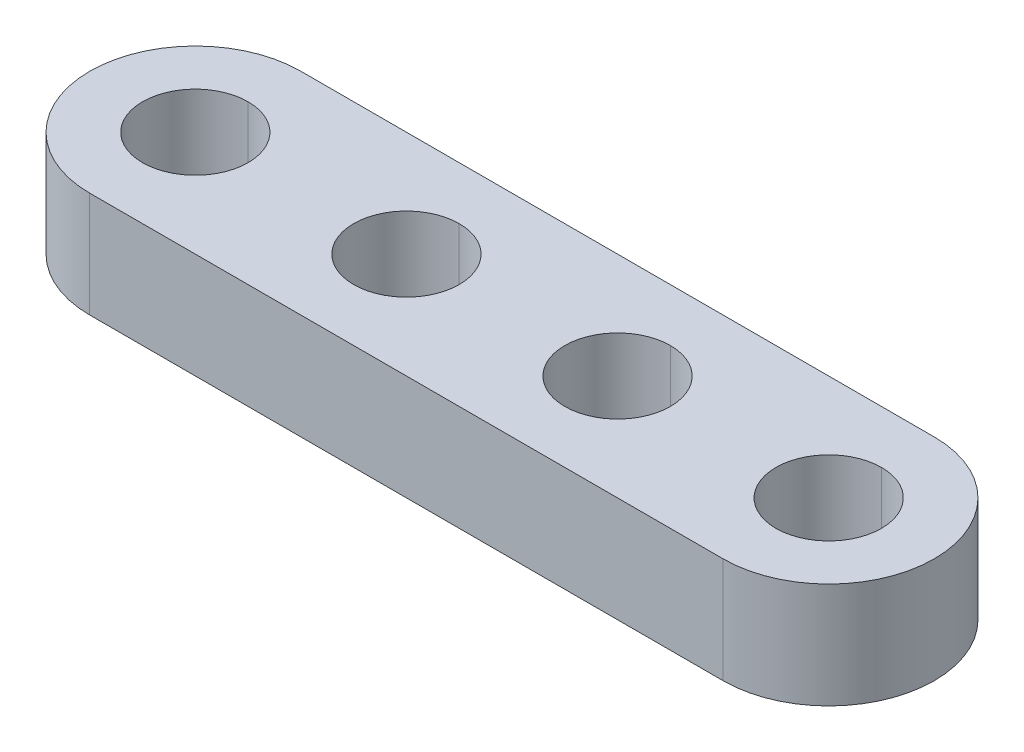
ISO-10303-21;
HEADER;
FILE_DESCRIPTION(('STEP AP214'),'2;1');
FILE_NAME('part.step','',(''),(''),'','','');
FILE_SCHEMA(('AUTOMOTIVE_DESIGN { 1 0 10303 214 1 1 1 1 }'));
ENDSEC;
DATA;
#1=APPLICATION_CONTEXT('core data for automotive mechanical design processes');
#2=APPLICATION_PROTOCOL_DEFINITION('international standard','automotive_design',2000,#1);
#3=PRODUCT_CONTEXT('',#1,'mechanical');
#4=PRODUCT('Part','Part','',(#3));
#5=PRODUCT_RELATED_PRODUCT_CATEGORY('part','',(#4));
#6=PRODUCT_DEFINITION_FORMATION('','',#4);
#7=PRODUCT_DEFINITION_CONTEXT('part definition',#1,'design');
#8=PRODUCT_DEFINITION('design','',#6,#7);
#9=PRODUCT_DEFINITION_SHAPE('','',#8);
#10=(LENGTH_UNIT() NAMED_UNIT(*) SI_UNIT(.MILLI.,.METRE.));
#11=(NAMED_UNIT(*) PLANE_ANGLE_UNIT() SI_UNIT($,.RADIAN.));
#12=(NAMED_UNIT(*) SI_UNIT($,.STERADIAN.) SOLID_ANGLE_UNIT());
#13=UNCERTAINTY_MEASURE_WITH_UNIT(LENGTH_MEASURE(1.E-05),#10,'distance_accuracy_value','');
#14=(GEOMETRIC_REPRESENTATION_CONTEXT(3) GLOBAL_UNCERTAINTY_ASSIGNED_CONTEXT((#13)) GLOBAL_UNIT_ASSIGNED_CONTEXT((#10,
#11,#12)) REPRESENTATION_CONTEXT('',''));
#15=CARTESIAN_POINT('',(0.,0.,0.));
#16=DIRECTION('',(0.,0.,1.));
#17=DIRECTION('',(1.,0.,0.));
#18=AXIS2_PLACEMENT_3D('',#15,#16,#17);
#19=CARTESIAN_POINT('',(12.,4.,0.));
#20=DIRECTION('',(0.,1.,0.));
#21=DIRECTION('',(0.,0.,1.));
#22=AXIS2_PLACEMENT_3D('',#19,#20,#21);
#23=CYLINDRICAL_SURFACE('',#22,2.);
#24=DIRECTION('',(0.,1.,0.));
#25=VECTOR('',#24,1.);
#26=CARTESIAN_POINT('',(12.,4.,-2.));
#27=LINE('',#26,#25);
#28=CARTESIAN_POINT('',(12.,0.,-2.));
#29=VERTEX_POINT('',#28);
#30=CARTESIAN_POINT('',(12.,4.,-2.));
#31=VERTEX_POINT('',#30);
#32=EDGE_CURVE('E249',#29,#31,#27,.T.);
#33=ORIENTED_EDGE('',*,*,#32,.F.);
#34=CARTESIAN_POINT('',(12.,0.,0.));
#35=DIRECTION('',(0.,1.,0.));
#36=DIRECTION('',(0.,0.,1.));
#37=AXIS2_PLACEMENT_3D('',#34,#35,#36);
#38=CIRCLE('',#37,2.);
#39=CARTESIAN_POINT('',(12.,0.,2.));
#40=VERTEX_POINT('',#39);
#41=EDGE_CURVE('E176',#40,#29,#38,.T.);
#42=ORIENTED_EDGE('',*,*,#41,.F.);
#43=DIRECTION('',(0.,1.,0.));
#44=VECTOR('',#43,1.);
#45=CARTESIAN_POINT('',(12.,4.,2.));
#46=LINE('',#45,#44);
#47=CARTESIAN_POINT('',(12.,4.,2.));
#48=VERTEX_POINT('',#47);
#49=EDGE_CURVE('E217',#40,#48,#46,.T.);
#50=ORIENTED_EDGE('',*,*,#49,.T.);
#51=CARTESIAN_POINT('',(12.,4.,0.));
#52=DIRECTION('',(0.,1.,0.));
#53=DIRECTION('',(0.,0.,1.));
#54=AXIS2_PLACEMENT_3D('',#51,#52,#53);
#55=CIRCLE('',#54,2.);
#56=EDGE_CURVE('E196',#48,#31,#55,.T.);
#57=ORIENTED_EDGE('',*,*,#56,.T.);
#58=EDGE_LOOP('',(#33,#42,#50,#57));
#59=FACE_BOUND('',#58,.T.);
#60=ADVANCED_FACE('F14',(#59),#23,.F.);
#61=CARTESIAN_POINT('',(4.,4.,0.));
#62=DIRECTION('',(0.,1.,0.));
#63=DIRECTION('',(0.,0.,1.));
#64=AXIS2_PLACEMENT_3D('',#61,#62,#63);
#65=CYLINDRICAL_SURFACE('',#64,2.);
#66=DIRECTION('',(0.,1.,0.));
#67=VECTOR('',#66,1.);
#68=CARTESIAN_POINT('',(4.,4.,-2.));
#69=LINE('',#68,#67);
#70=CARTESIAN_POINT('',(4.,0.,-2.));
#71=VERTEX_POINT('',#70);
#72=CARTESIAN_POINT('',(4.,4.,-2.));
#73=VERTEX_POINT('',#72);
#74=EDGE_CURVE('E216',#71,#73,#69,.T.);
#75=ORIENTED_EDGE('',*,*,#74,.F.);
#76=CARTESIAN_POINT('',(4.,0.,0.));
#77=DIRECTION('',(0.,1.,0.));
#78=DIRECTION('',(0.,0.,1.));
#79=AXIS2_PLACEMENT_3D('',#76,#77,#78);
#80=CIRCLE('',#79,2.);
#81=CARTESIAN_POINT('',(4.,0.,2.));
#82=VERTEX_POINT('',#81);
#83=EDGE_CURVE('E183',#82,#71,#80,.T.);
#84=ORIENTED_EDGE('',*,*,#83,.F.);
#85=DIRECTION('',(0.,1.,0.));
#86=VECTOR('',#85,1.);
#87=CARTESIAN_POINT('',(4.,4.,2.));
#88=LINE('',#87,#86);
#89=CARTESIAN_POINT('',(4.,4.,2.));
#90=VERTEX_POINT('',#89);
#91=EDGE_CURVE('E226',#82,#90,#88,.T.);
#92=ORIENTED_EDGE('',*,*,#91,.T.);
#93=CARTESIAN_POINT('',(4.,4.,0.));
#94=DIRECTION('',(0.,1.,0.));
#95=DIRECTION('',(0.,0.,1.));
#96=AXIS2_PLACEMENT_3D('',#93,#94,#95);
#97=CIRCLE('',#96,2.);
#98=EDGE_CURVE('E186',#90,#73,#97,.T.);
#99=ORIENTED_EDGE('',*,*,#98,.T.);
#100=EDGE_LOOP('',(#75,#84,#92,#99));
#101=FACE_BOUND('',#100,.T.);
#102=ADVANCED_FACE('F16',(#101),#65,.F.);
#103=CARTESIAN_POINT('',(-4.,4.,0.));
#104=DIRECTION('',(0.,1.,0.));
#105=DIRECTION('',(0.,0.,1.));
#106=AXIS2_PLACEMENT_3D('',#103,#104,#105);
#107=CYLINDRICAL_SURFACE('',#106,2.);
#108=DIRECTION('',(0.,1.,0.));
#109=VECTOR('',#108,1.);
#110=CARTESIAN_POINT('',(-4.,4.,-2.));
#111=LINE('',#110,#109);
#112=CARTESIAN_POINT('',(-4.,0.,-2.));
#113=VERTEX_POINT('',#112);
#114=CARTESIAN_POINT('',(-4.,4.,-2.));
#115=VERTEX_POINT('',#114);
#116=EDGE_CURVE('E206',#113,#115,#111,.T.);
#117=ORIENTED_EDGE('',*,*,#116,.F.);
#118=CARTESIAN_POINT('',(-4.,0.,0.));
#119=DIRECTION('',(0.,1.,0.));
#120=DIRECTION('',(0.,0.,1.));
#121=AXIS2_PLACEMENT_3D('',#118,#119,#120);
#122=CIRCLE('',#121,2.);
#123=CARTESIAN_POINT('',(-4.,0.,2.));
#124=VERTEX_POINT('',#123);
#125=EDGE_CURVE('E25',#124,#113,#122,.T.);
#126=ORIENTED_EDGE('',*,*,#125,.F.);
#127=DIRECTION('',(0.,1.,0.));
#128=VECTOR('',#127,1.);
#129=CARTESIAN_POINT('',(-4.,4.,2.));
#130=LINE('',#129,#128);
#131=CARTESIAN_POINT('',(-4.,4.,2.));
#132=VERTEX_POINT('',#131);
#133=EDGE_CURVE('E199',#124,#132,#130,.T.);
#134=ORIENTED_EDGE('',*,*,#133,.T.);
#135=CARTESIAN_POINT('',(-4.,4.,0.));
#136=DIRECTION('',(0.,1.,0.));
#137=DIRECTION('',(0.,0.,1.));
#138=AXIS2_PLACEMENT_3D('',#135,#136,#137);
#139=CIRCLE('',#138,2.);
#140=EDGE_CURVE('E177',#132,#115,#139,.T.);
#141=ORIENTED_EDGE('',*,*,#140,.T.);
#142=EDGE_LOOP('',(#117,#126,#134,#141));
#143=FACE_BOUND('',#142,.T.);
#144=ADVANCED_FACE('F279',(#143),#107,.F.);
#145=CARTESIAN_POINT('',(-12.,4.,0.));
#146=DIRECTION('',(0.,1.,0.));
#147=DIRECTION('',(0.,0.,1.));
#148=AXIS2_PLACEMENT_3D('',#145,#146,#147);
#149=CYLINDRICAL_SURFACE('',#148,2.);
#150=DIRECTION('',(0.,1.,0.));
#151=VECTOR('',#150,1.);
#152=CARTESIAN_POINT('',(-12.,4.,-2.));
#153=LINE('',#152,#151);
#154=CARTESIAN_POINT('',(-12.,0.,-2.));
#155=VERTEX_POINT('',#154);
#156=CARTESIAN_POINT('',(-12.,4.,-2.));
#157=VERTEX_POINT('',#156);
#158=EDGE_CURVE('E18',#155,#157,#153,.T.);
#159=ORIENTED_EDGE('',*,*,#158,.F.);
#160=CARTESIAN_POINT('',(-12.,0.,0.));
#161=DIRECTION('',(0.,1.,0.));
#162=DIRECTION('',(0.,0.,1.));
#163=AXIS2_PLACEMENT_3D('',#160,#161,#162);
#164=CIRCLE('',#163,2.);
#165=CARTESIAN_POINT('',(-12.,0.,2.));
#166=VERTEX_POINT('',#165);
#167=EDGE_CURVE('E9',#166,#155,#164,.T.);
#168=ORIENTED_EDGE('',*,*,#167,.F.);
#169=DIRECTION('',(0.,1.,0.));
#170=VECTOR('',#169,1.);
#171=CARTESIAN_POINT('',(-12.,4.,2.));
#172=LINE('',#171,#170);
#173=CARTESIAN_POINT('',(-12.,4.,2.));
#174=VERTEX_POINT('',#173);
#175=EDGE_CURVE('E218',#166,#174,#172,.T.);
#176=ORIENTED_EDGE('',*,*,#175,.T.);
#177=CARTESIAN_POINT('',(-12.,4.,0.));
#178=DIRECTION('',(0.,1.,0.));
#179=DIRECTION('',(0.,0.,1.));
#180=AXIS2_PLACEMENT_3D('',#177,#178,#179);
#181=CIRCLE('',#180,2.);
#182=EDGE_CURVE('E125',#174,#157,#181,.T.);
#183=ORIENTED_EDGE('',*,*,#182,.T.);
#184=EDGE_LOOP('',(#159,#168,#176,#183));
#185=FACE_BOUND('',#184,.T.);
#186=ADVANCED_FACE('F299',(#185),#149,.F.);
#187=CARTESIAN_POINT('',(-12.,0.,0.));
#188=DIRECTION('',(0.,1.,0.));
#189=DIRECTION('',(1.,0.,0.));
#190=AXIS2_PLACEMENT_3D('',#187,#188,#189);
#191=PLANE('',#190);
#192=ORIENTED_EDGE('',*,*,#167,.T.);
#193=CARTESIAN_POINT('',(-12.,0.,0.));
#194=DIRECTION('',(0.,1.,0.));
#195=DIRECTION('',(0.,0.,1.));
#196=AXIS2_PLACEMENT_3D('',#193,#194,#195);
#197=CIRCLE('',#196,2.);
#198=EDGE_CURVE('E282',#155,#166,#197,.T.);
#199=ORIENTED_EDGE('',*,*,#198,.T.);
#200=EDGE_LOOP('',(#192,#199));
#201=FACE_BOUND('',#200,.T.);
#202=ORIENTED_EDGE('',*,*,#125,.T.);
#203=CARTESIAN_POINT('',(-4.,0.,0.));
#204=DIRECTION('',(0.,1.,0.));
#205=DIRECTION('',(0.,0.,1.));
#206=AXIS2_PLACEMENT_3D('',#203,#204,#205);
#207=CIRCLE('',#206,2.);
#208=EDGE_CURVE('E211',#113,#124,#207,.T.);
#209=ORIENTED_EDGE('',*,*,#208,.T.);
#210=EDGE_LOOP('',(#202,#209));
#211=FACE_BOUND('',#210,.T.);
#212=ORIENTED_EDGE('',*,*,#83,.T.);
#213=CARTESIAN_POINT('',(4.,0.,0.));
#214=DIRECTION('',(0.,1.,0.));
#215=DIRECTION('',(0.,0.,1.));
#216=AXIS2_PLACEMENT_3D('',#213,#214,#215);
#217=CIRCLE('',#216,2.);
#218=EDGE_CURVE('E212',#71,#82,#217,.T.);
#219=ORIENTED_EDGE('',*,*,#218,.T.);
#220=EDGE_LOOP('',(#212,#219));
#221=FACE_BOUND('',#220,.T.);
#222=ORIENTED_EDGE('',*,*,#41,.T.);
#223=CARTESIAN_POINT('',(12.,0.,0.));
#224=DIRECTION('',(0.,1.,0.));
#225=DIRECTION('',(0.,0.,1.));
#226=AXIS2_PLACEMENT_3D('',#223,#224,#225);
#227=CIRCLE('',#226,2.);
#228=EDGE_CURVE('E253',#29,#40,#227,.T.);
#229=ORIENTED_EDGE('',*,*,#228,.T.);
#230=EDGE_LOOP('',(#222,#229));
#231=FACE_BOUND('',#230,.T.);
#232=CARTESIAN_POINT('',(-12.,0.,0.));
#233=DIRECTION('',(0.,1.,0.));
#234=DIRECTION('',(0.,0.,1.));
#235=AXIS2_PLACEMENT_3D('',#232,#233,#234);
#236=CIRCLE('',#235,4.);
#237=CARTESIAN_POINT('',(-12.,0.,-4.));
#238=VERTEX_POINT('',#237);
#239=CARTESIAN_POINT('',(-12.,0.,4.));
#240=VERTEX_POINT('',#239);
#241=EDGE_CURVE('E221',#238,#240,#236,.T.);
#242=ORIENTED_EDGE('',*,*,#241,.F.);
#243=DIRECTION('',(-1.,0.,0.));
#244=VECTOR('',#243,1.);
#245=CARTESIAN_POINT('',(-12.,0.,-4.));
#246=LINE('',#245,#244);
#247=CARTESIAN_POINT('',(12.,0.,-4.));
#248=VERTEX_POINT('',#247);
#249=EDGE_CURVE('E113',#248,#238,#246,.T.);
#250=ORIENTED_EDGE('',*,*,#249,.F.);
#251=CARTESIAN_POINT('',(12.,0.,0.));
#252=DIRECTION('',(0.,1.,0.));
#253=DIRECTION('',(0.,0.,1.));
#254=AXIS2_PLACEMENT_3D('',#251,#252,#253);
#255=CIRCLE('',#254,4.);
#256=CARTESIAN_POINT('',(12.,0.,4.));
#257=VERTEX_POINT('',#256);
#258=EDGE_CURVE('E160',#257,#248,#255,.T.);
#259=ORIENTED_EDGE('',*,*,#258,.F.);
#260=DIRECTION('',(1.,0.,0.));
#261=VECTOR('',#260,1.);
#262=CARTESIAN_POINT('',(-12.,0.,4.));
#263=LINE('',#262,#261);
#264=EDGE_CURVE('E162',#240,#257,#263,.T.);
#265=ORIENTED_EDGE('',*,*,#264,.F.);
#266=EDGE_LOOP('',(#242,#250,#259,#265));
#267=FACE_BOUND('',#266,.T.);
#268=ADVANCED_FACE('F275',(#201,#211,#221,#231,#267),#191,.F.);
#269=CARTESIAN_POINT('',(-12.,4.,0.));
#270=DIRECTION('',(0.,1.,0.));
#271=DIRECTION('',(1.,0.,0.));
#272=AXIS2_PLACEMENT_3D('',#269,#270,#271);
#273=PLANE('',#272);
#274=ORIENTED_EDGE('',*,*,#182,.F.);
#275=CARTESIAN_POINT('',(-12.,4.,0.));
#276=DIRECTION('',(0.,1.,0.));
#277=DIRECTION('',(0.,0.,1.));
#278=AXIS2_PLACEMENT_3D('',#275,#276,#277);
#279=CIRCLE('',#278,2.);
#280=EDGE_CURVE('E222',#157,#174,#279,.T.);
#281=ORIENTED_EDGE('',*,*,#280,.F.);
#282=EDGE_LOOP('',(#274,#281));
#283=FACE_BOUND('',#282,.T.);
#284=ORIENTED_EDGE('',*,*,#140,.F.);
#285=CARTESIAN_POINT('',(-4.,4.,0.));
#286=DIRECTION('',(0.,1.,0.));
#287=DIRECTION('',(0.,0.,1.));
#288=AXIS2_PLACEMENT_3D('',#285,#286,#287);
#289=CIRCLE('',#288,2.);
#290=EDGE_CURVE('E210',#115,#132,#289,.T.);
#291=ORIENTED_EDGE('',*,*,#290,.F.);
#292=EDGE_LOOP('',(#284,#291));
#293=FACE_BOUND('',#292,.T.);
#294=ORIENTED_EDGE('',*,*,#98,.F.);
#295=CARTESIAN_POINT('',(4.,4.,0.));
#296=DIRECTION('',(0.,1.,0.));
#297=DIRECTION('',(0.,0.,1.));
#298=AXIS2_PLACEMENT_3D('',#295,#296,#297);
#299=CIRCLE('',#298,2.);
#300=EDGE_CURVE('E223',#73,#90,#299,.T.);
#301=ORIENTED_EDGE('',*,*,#300,.F.);
#302=EDGE_LOOP('',(#294,#301));
#303=FACE_BOUND('',#302,.T.);
#304=ORIENTED_EDGE('',*,*,#56,.F.);
#305=CARTESIAN_POINT('',(12.,4.,0.));
#306=DIRECTION('',(0.,1.,0.));
#307=DIRECTION('',(0.,0.,1.));
#308=AXIS2_PLACEMENT_3D('',#305,#306,#307);
#309=CIRCLE('',#308,2.);
#310=EDGE_CURVE('E174',#31,#48,#309,.T.);
#311=ORIENTED_EDGE('',*,*,#310,.F.);
#312=EDGE_LOOP('',(#304,#311));
#313=FACE_BOUND('',#312,.T.);
#314=CARTESIAN_POINT('',(-12.,4.,0.));
#315=DIRECTION('',(0.,1.,0.));
#316=DIRECTION('',(0.,0.,1.));
#317=AXIS2_PLACEMENT_3D('',#314,#315,#316);
#318=CIRCLE('',#317,4.);
#319=CARTESIAN_POINT('',(-12.,4.,-4.));
#320=VERTEX_POINT('',#319);
#321=CARTESIAN_POINT('',(-12.,4.,4.));
#322=VERTEX_POINT('',#321);
#323=EDGE_CURVE('E155',#320,#322,#318,.T.);
#324=ORIENTED_EDGE('',*,*,#323,.T.);
#325=DIRECTION('',(1.,0.,0.));
#326=VECTOR('',#325,1.);
#327=CARTESIAN_POINT('',(-12.,4.,4.));
#328=LINE('',#327,#326);
#329=CARTESIAN_POINT('',(12.,4.,4.));
#330=VERTEX_POINT('',#329);
#331=EDGE_CURVE('E152',#322,#330,#328,.T.);
#332=ORIENTED_EDGE('',*,*,#331,.T.);
#333=CARTESIAN_POINT('',(12.,4.,0.));
#334=DIRECTION('',(0.,1.,0.));
#335=DIRECTION('',(0.,0.,1.));
#336=AXIS2_PLACEMENT_3D('',#333,#334,#335);
#337=CIRCLE('',#336,4.);
#338=CARTESIAN_POINT('',(12.,4.,-4.));
#339=VERTEX_POINT('',#338);
#340=EDGE_CURVE('E140',#330,#339,#337,.T.);
#341=ORIENTED_EDGE('',*,*,#340,.T.);
#342=DIRECTION('',(-1.,0.,0.));
#343=VECTOR('',#342,1.);
#344=CARTESIAN_POINT('',(-12.,4.,-4.));
#345=LINE('',#344,#343);
#346=EDGE_CURVE('E40',#339,#320,#345,.T.);
#347=ORIENTED_EDGE('',*,*,#346,.T.);
#348=EDGE_LOOP('',(#324,#332,#341,#347));
#349=FACE_BOUND('',#348,.T.);
#350=ADVANCED_FACE('F153',(#283,#293,#303,#313,#349),#273,.T.);
#351=CARTESIAN_POINT('',(-12.,4.,-4.));
#352=DIRECTION('',(0.,0.,1.));
#353=DIRECTION('',(1.,0.,0.));
#354=AXIS2_PLACEMENT_3D('',#351,#352,#353);
#355=PLANE('',#354);
#356=ORIENTED_EDGE('',*,*,#249,.T.);
#357=DIRECTION('',(0.,-1.,0.));
#358=VECTOR('',#357,1.);
#359=CARTESIAN_POINT('',(-12.,4.,-4.));
#360=LINE('',#359,#358);
#361=EDGE_CURVE('E170',#320,#238,#360,.T.);
#362=ORIENTED_EDGE('',*,*,#361,.F.);
#363=ORIENTED_EDGE('',*,*,#346,.F.);
#364=DIRECTION('',(0.,-1.,0.));
#365=VECTOR('',#364,1.);
#366=CARTESIAN_POINT('',(12.,4.,-4.));
#367=LINE('',#366,#365);
#368=EDGE_CURVE('E147',#339,#248,#367,.T.);
#369=ORIENTED_EDGE('',*,*,#368,.T.);
#370=EDGE_LOOP('',(#356,#362,#363,#369));
#371=FACE_BOUND('',#370,.T.);
#372=ADVANCED_FACE('F307',(#371),#355,.F.);
#373=CARTESIAN_POINT('',(12.,4.,0.));
#374=DIRECTION('',(0.,-1.,0.));
#375=DIRECTION('',(0.,0.,-1.));
#376=AXIS2_PLACEMENT_3D('',#373,#374,#375);
#377=CYLINDRICAL_SURFACE('',#376,4.);
#378=ORIENTED_EDGE('',*,*,#258,.T.);
#379=ORIENTED_EDGE('',*,*,#368,.F.);
#380=ORIENTED_EDGE('',*,*,#340,.F.);
#381=DIRECTION('',(0.,-1.,0.));
#382=VECTOR('',#381,1.);
#383=CARTESIAN_POINT('',(12.,4.,4.));
#384=LINE('',#383,#382);
#385=EDGE_CURVE('E145',#330,#257,#384,.T.);
#386=ORIENTED_EDGE('',*,*,#385,.T.);
#387=EDGE_LOOP('',(#378,#379,#380,#386));
#388=FACE_BOUND('',#387,.T.);
#389=ADVANCED_FACE('F143',(#388),#377,.T.);
#390=CARTESIAN_POINT('',(-12.,4.,4.));
#391=DIRECTION('',(0.,0.,-1.));
#392=DIRECTION('',(0.,-1.,0.));
#393=AXIS2_PLACEMENT_3D('',#390,#391,#392);
#394=PLANE('',#393);
#395=ORIENTED_EDGE('',*,*,#264,.T.);
#396=ORIENTED_EDGE('',*,*,#385,.F.);
#397=ORIENTED_EDGE('',*,*,#331,.F.);
#398=DIRECTION('',(0.,-1.,0.));
#399=VECTOR('',#398,1.);
#400=CARTESIAN_POINT('',(-12.,4.,4.));
#401=LINE('',#400,#399);
#402=EDGE_CURVE('E242',#322,#240,#401,.T.);
#403=ORIENTED_EDGE('',*,*,#402,.T.);
#404=EDGE_LOOP('',(#395,#396,#397,#403));
#405=FACE_BOUND('',#404,.T.);
#406=ADVANCED_FACE('F161',(#405),#394,.F.);
#407=CARTESIAN_POINT('',(-12.,4.,0.));
#408=DIRECTION('',(0.,-1.,0.));
#409=DIRECTION('',(0.,0.,-1.));
#410=AXIS2_PLACEMENT_3D('',#407,#408,#409);
#411=CYLINDRICAL_SURFACE('',#410,4.);
#412=ORIENTED_EDGE('',*,*,#241,.T.);
#413=ORIENTED_EDGE('',*,*,#402,.F.);
#414=ORIENTED_EDGE('',*,*,#323,.F.);
#415=ORIENTED_EDGE('',*,*,#361,.T.);
#416=EDGE_LOOP('',(#412,#413,#414,#415));
#417=FACE_BOUND('',#416,.T.);
#418=ADVANCED_FACE('F380',(#417),#411,.T.);
#419=CARTESIAN_POINT('',(-12.,4.,0.));
#420=DIRECTION('',(0.,1.,0.));
#421=DIRECTION('',(0.,0.,1.));
#422=AXIS2_PLACEMENT_3D('',#419,#420,#421);
#423=CYLINDRICAL_SURFACE('',#422,2.);
#424=ORIENTED_EDGE('',*,*,#198,.F.);
#425=ORIENTED_EDGE('',*,*,#158,.T.);
#426=ORIENTED_EDGE('',*,*,#280,.T.);
#427=ORIENTED_EDGE('',*,*,#175,.F.);
#428=EDGE_LOOP('',(#424,#425,#426,#427));
#429=FACE_BOUND('',#428,.T.);
#430=ADVANCED_FACE('F297',(#429),#423,.F.);
#431=CARTESIAN_POINT('',(-4.,4.,0.));
#432=DIRECTION('',(0.,1.,0.));
#433=DIRECTION('',(0.,0.,1.));
#434=AXIS2_PLACEMENT_3D('',#431,#432,#433);
#435=CYLINDRICAL_SURFACE('',#434,2.);
#436=ORIENTED_EDGE('',*,*,#208,.F.);
#437=ORIENTED_EDGE('',*,*,#116,.T.);
#438=ORIENTED_EDGE('',*,*,#290,.T.);
#439=ORIENTED_EDGE('',*,*,#133,.F.);
#440=EDGE_LOOP('',(#436,#437,#438,#439));
#441=FACE_BOUND('',#440,.T.);
#442=ADVANCED_FACE('F281',(#441),#435,.F.);
#443=CARTESIAN_POINT('',(4.,4.,0.));
#444=DIRECTION('',(0.,1.,0.));
#445=DIRECTION('',(0.,0.,1.));
#446=AXIS2_PLACEMENT_3D('',#443,#444,#445);
#447=CYLINDRICAL_SURFACE('',#446,2.);
#448=ORIENTED_EDGE('',*,*,#218,.F.);
#449=ORIENTED_EDGE('',*,*,#74,.T.);
#450=ORIENTED_EDGE('',*,*,#300,.T.);
#451=ORIENTED_EDGE('',*,*,#91,.F.);
#452=EDGE_LOOP('',(#448,#449,#450,#451));
#453=FACE_BOUND('',#452,.T.);
#454=ADVANCED_FACE('F321',(#453),#447,.F.);
#455=CARTESIAN_POINT('',(12.,4.,0.));
#456=DIRECTION('',(0.,1.,0.));
#457=DIRECTION('',(0.,0.,1.));
#458=AXIS2_PLACEMENT_3D('',#455,#456,#457);
#459=CYLINDRICAL_SURFACE('',#458,2.);
#460=ORIENTED_EDGE('',*,*,#228,.F.);
#461=ORIENTED_EDGE('',*,*,#32,.T.);
#462=ORIENTED_EDGE('',*,*,#310,.T.);
#463=ORIENTED_EDGE('',*,*,#49,.F.);
#464=EDGE_LOOP('',(#460,#461,#462,#463));
#465=FACE_BOUND('',#464,.T.);
#466=ADVANCED_FACE('F324',(#465),#459,.F.);
#467=CLOSED_SHELL('',(#60,#102,#144,#186,#268,#350,#372,#389,#406,#418,#430,#442,#454,#466));
#468=MANIFOLD_SOLID_BREP('B1',#467);
#469=ADVANCED_BREP_SHAPE_REPRESENTATION('',(#18,#468),#14);
#470=SHAPE_DEFINITION_REPRESENTATION(#9,#469);
ENDSEC;
END-ISO-10303-21;
